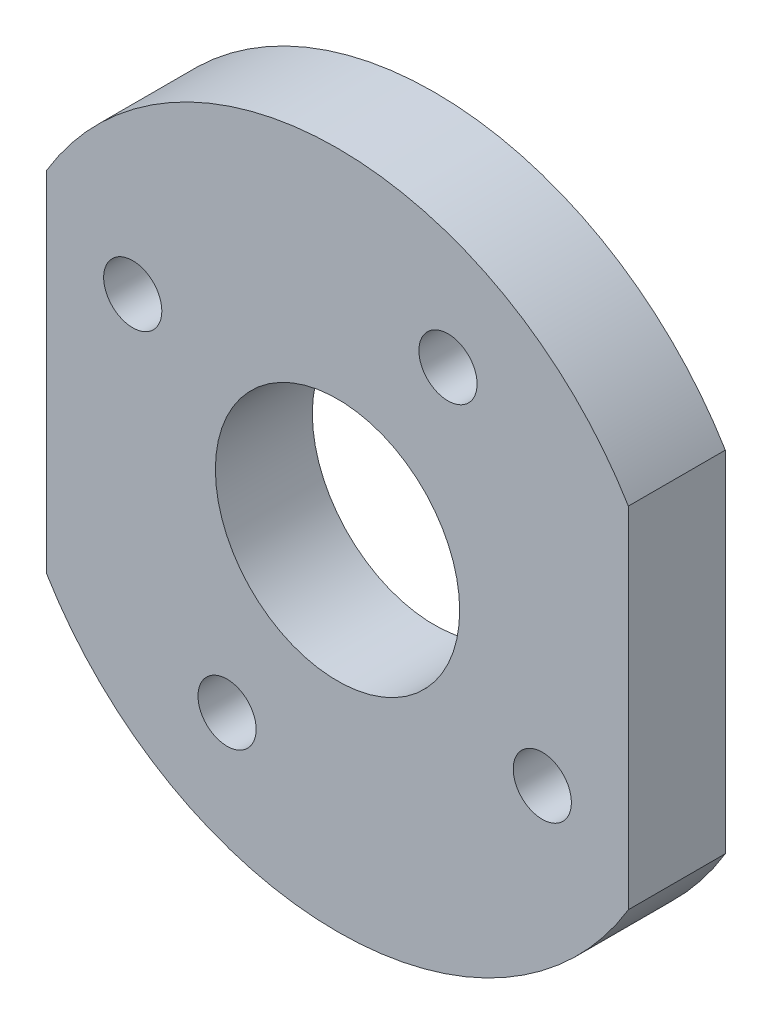
ISO-10303-21;
HEADER;
FILE_DESCRIPTION(('STEP AP214'),'2;1');
FILE_NAME('part.step','',(''),(''),'','','');
FILE_SCHEMA(('AUTOMOTIVE_DESIGN { 1 0 10303 214 1 1 1 1 }'));
ENDSEC;
DATA;
#1=APPLICATION_CONTEXT('core data for automotive mechanical design processes');
#2=APPLICATION_PROTOCOL_DEFINITION('international standard','automotive_design',2000,#1);
#3=PRODUCT_CONTEXT('',#1,'mechanical');
#4=PRODUCT('Part','Part','',(#3));
#5=PRODUCT_RELATED_PRODUCT_CATEGORY('part','',(#4));
#6=PRODUCT_DEFINITION_FORMATION('','',#4);
#7=PRODUCT_DEFINITION_CONTEXT('part definition',#1,'design');
#8=PRODUCT_DEFINITION('design','',#6,#7);
#9=PRODUCT_DEFINITION_SHAPE('','',#8);
#10=(LENGTH_UNIT() NAMED_UNIT(*) SI_UNIT(.MILLI.,.METRE.));
#11=(NAMED_UNIT(*) PLANE_ANGLE_UNIT() SI_UNIT($,.RADIAN.));
#12=(NAMED_UNIT(*) SI_UNIT($,.STERADIAN.) SOLID_ANGLE_UNIT());
#13=UNCERTAINTY_MEASURE_WITH_UNIT(LENGTH_MEASURE(1.E-05),#10,'distance_accuracy_value','');
#14=(GEOMETRIC_REPRESENTATION_CONTEXT(3) GLOBAL_UNCERTAINTY_ASSIGNED_CONTEXT((#13)) GLOBAL_UNIT_ASSIGNED_CONTEXT((#10,
#11,#12)) REPRESENTATION_CONTEXT('',''));
#15=CARTESIAN_POINT('',(0.,0.,0.));
#16=DIRECTION('',(0.,0.,1.));
#17=DIRECTION('',(1.,0.,0.));
#18=AXIS2_PLACEMENT_3D('',#15,#16,#17);
#19=CARTESIAN_POINT('',(11.3450830399455,56.0226036821632,5.));
#20=DIRECTION('',(0.,0.,1.));
#21=DIRECTION('',(1.,0.,0.));
#22=AXIS2_PLACEMENT_3D('',#19,#20,#21);
#23=PLANE('',#22);
#24=CARTESIAN_POINT('',(0.783804127321347,61.7199177625855,5.));
#25=DIRECTION('',(0.,0.,1.));
#26=DIRECTION('',(1.,0.,0.));
#27=AXIS2_PLACEMENT_3D('',#24,#25,#26);
#28=CIRCLE('',#27,1.5);
#29=CARTESIAN_POINT('',(2.28380412732135,61.7199177625855,5.));
#30=VERTEX_POINT('',#29);
#31=EDGE_CURVE('E128',#30,#30,#28,.T.);
#32=ORIENTED_EDGE('',*,*,#31,.F.);
#33=EDGE_LOOP('',(#32));
#34=FACE_BOUND('',#33,.T.);
#35=CARTESIAN_POINT('',(17.0423971202988,66.5838825947678,5.));
#36=DIRECTION('',(0.,0.,1.));
#37=DIRECTION('',(1.,0.,0.));
#38=AXIS2_PLACEMENT_3D('',#35,#36,#37);
#39=CIRCLE('',#38,1.5);
#40=CARTESIAN_POINT('',(18.5423971202988,66.5838825947678,5.));
#41=VERTEX_POINT('',#40);
#42=EDGE_CURVE('E116',#41,#41,#39,.T.);
#43=ORIENTED_EDGE('',*,*,#42,.F.);
#44=EDGE_LOOP('',(#43));
#45=FACE_BOUND('',#44,.T.);
#46=CARTESIAN_POINT('',(11.3450830399455,56.0226036821632,5.));
#47=DIRECTION('',(0.,0.,1.));
#48=DIRECTION('',(1.,0.,0.));
#49=AXIS2_PLACEMENT_3D('',#46,#47,#48);
#50=CIRCLE('',#49,17.5);
#51=CARTESIAN_POINT('',(-3.65491696005452,47.0087254935032,5.));
#52=VERTEX_POINT('',#51);
#53=CARTESIAN_POINT('',(26.3450830399455,47.0087254935032,5.));
#54=VERTEX_POINT('',#53);
#55=EDGE_CURVE('E86',#52,#54,#50,.T.);
#56=ORIENTED_EDGE('',*,*,#55,.T.);
#57=DIRECTION('',(0.,1.,0.));
#58=VECTOR('',#57,1.);
#59=CARTESIAN_POINT('',(26.3450830399455,65.0364818708231,5.));
#60=LINE('',#59,#58);
#61=CARTESIAN_POINT('',(26.3450830399455,65.0364818708231,5.));
#62=VERTEX_POINT('',#61);
#63=EDGE_CURVE('E81',#54,#62,#60,.T.);
#64=ORIENTED_EDGE('',*,*,#63,.T.);
#65=CARTESIAN_POINT('',(11.3450830399455,56.0226036821632,5.));
#66=DIRECTION('',(0.,0.,1.));
#67=DIRECTION('',(1.,0.,0.));
#68=AXIS2_PLACEMENT_3D('',#65,#66,#67);
#69=CIRCLE('',#68,17.5);
#70=CARTESIAN_POINT('',(-3.65491696005452,65.0364818708231,5.));
#71=VERTEX_POINT('',#70);
#72=EDGE_CURVE('E84',#62,#71,#69,.T.);
#73=ORIENTED_EDGE('',*,*,#72,.T.);
#74=DIRECTION('',(0.,-1.,0.));
#75=VECTOR('',#74,1.);
#76=CARTESIAN_POINT('',(-3.65491696005452,65.0364818708231,5.));
#77=LINE('',#76,#75);
#78=EDGE_CURVE('E51',#71,#52,#77,.T.);
#79=ORIENTED_EDGE('',*,*,#78,.T.);
#80=EDGE_LOOP('',(#56,#64,#73,#79));
#81=FACE_BOUND('',#80,.T.);
#82=CARTESIAN_POINT('',(11.3450830399455,56.0226036821632,5.));
#83=DIRECTION('',(0.,0.,1.));
#84=DIRECTION('',(1.,0.,0.));
#85=AXIS2_PLACEMENT_3D('',#82,#83,#84);
#86=CIRCLE('',#85,6.3);
#87=CARTESIAN_POINT('',(17.6450830399455,56.0226036821632,5.));
#88=VERTEX_POINT('',#87);
#89=EDGE_CURVE('E101',#88,#88,#86,.T.);
#90=ORIENTED_EDGE('',*,*,#89,.F.);
#91=EDGE_LOOP('',(#90));
#92=FACE_BOUND('',#91,.T.);
#93=CARTESIAN_POINT('',(5.64776895950356,45.4613247696081,5.));
#94=DIRECTION('',(0.,0.,1.));
#95=DIRECTION('',(1.,0.,0.));
#96=AXIS2_PLACEMENT_3D('',#93,#94,#95);
#97=CIRCLE('',#96,1.5);
#98=CARTESIAN_POINT('',(7.14776895950356,45.4613247696081,5.));
#99=VERTEX_POINT('',#98);
#100=EDGE_CURVE('E122',#99,#99,#97,.T.);
#101=ORIENTED_EDGE('',*,*,#100,.F.);
#102=EDGE_LOOP('',(#101));
#103=FACE_BOUND('',#102,.T.);
#104=CARTESIAN_POINT('',(21.9063619524873,50.3252896017871,5.));
#105=DIRECTION('',(0.,0.,1.));
#106=DIRECTION('',(1.,0.,0.));
#107=AXIS2_PLACEMENT_3D('',#104,#105,#106);
#108=CIRCLE('',#107,1.5);
#109=CARTESIAN_POINT('',(23.4063619524873,50.3252896017871,5.));
#110=VERTEX_POINT('',#109);
#111=EDGE_CURVE('E134',#110,#110,#108,.T.);
#112=ORIENTED_EDGE('',*,*,#111,.F.);
#113=EDGE_LOOP('',(#112));
#114=FACE_BOUND('',#113,.T.);
#115=ADVANCED_FACE('F34',(#34,#45,#81,#92,#103,#114),#23,.T.);
#116=CARTESIAN_POINT('',(11.3450830399455,56.0226036821632,0.));
#117=DIRECTION('',(0.,0.,1.));
#118=DIRECTION('',(1.,0.,0.));
#119=AXIS2_PLACEMENT_3D('',#116,#117,#118);
#120=PLANE('',#119);
#121=CARTESIAN_POINT('',(11.3450830399455,56.0226036821632,0.));
#122=DIRECTION('',(0.,0.,1.));
#123=DIRECTION('',(1.,0.,0.));
#124=AXIS2_PLACEMENT_3D('',#121,#122,#123);
#125=CIRCLE('',#124,17.5);
#126=CARTESIAN_POINT('',(-3.65491696005452,47.0087254935032,0.));
#127=VERTEX_POINT('',#126);
#128=CARTESIAN_POINT('',(26.3450830399455,47.0087254935032,0.));
#129=VERTEX_POINT('',#128);
#130=EDGE_CURVE('E98',#127,#129,#125,.T.);
#131=ORIENTED_EDGE('',*,*,#130,.F.);
#132=DIRECTION('',(0.,-1.,0.));
#133=VECTOR('',#132,1.);
#134=CARTESIAN_POINT('',(-3.65491696005452,65.0364818708231,0.));
#135=LINE('',#134,#133);
#136=CARTESIAN_POINT('',(-3.65491696005452,65.0364818708231,0.));
#137=VERTEX_POINT('',#136);
#138=EDGE_CURVE('E74',#137,#127,#135,.T.);
#139=ORIENTED_EDGE('',*,*,#138,.F.);
#140=CARTESIAN_POINT('',(11.3450830399455,56.0226036821632,0.));
#141=DIRECTION('',(0.,0.,1.));
#142=DIRECTION('',(1.,0.,0.));
#143=AXIS2_PLACEMENT_3D('',#140,#141,#142);
#144=CIRCLE('',#143,17.5);
#145=CARTESIAN_POINT('',(26.3450830399455,65.0364818708231,0.));
#146=VERTEX_POINT('',#145);
#147=EDGE_CURVE('E68',#146,#137,#144,.T.);
#148=ORIENTED_EDGE('',*,*,#147,.F.);
#149=DIRECTION('',(0.,1.,0.));
#150=VECTOR('',#149,1.);
#151=CARTESIAN_POINT('',(26.3450830399455,65.0364818708231,0.));
#152=LINE('',#151,#150);
#153=EDGE_CURVE('E90',#129,#146,#152,.T.);
#154=ORIENTED_EDGE('',*,*,#153,.F.);
#155=EDGE_LOOP('',(#131,#139,#148,#154));
#156=FACE_BOUND('',#155,.T.);
#157=CARTESIAN_POINT('',(11.3450830399455,56.0226036821632,0.));
#158=DIRECTION('',(0.,0.,1.));
#159=DIRECTION('',(1.,0.,0.));
#160=AXIS2_PLACEMENT_3D('',#157,#158,#159);
#161=CIRCLE('',#160,6.3);
#162=CARTESIAN_POINT('',(17.6450830399455,56.0226036821632,0.));
#163=VERTEX_POINT('',#162);
#164=EDGE_CURVE('E113',#163,#163,#161,.T.);
#165=ORIENTED_EDGE('',*,*,#164,.T.);
#166=EDGE_LOOP('',(#165));
#167=FACE_BOUND('',#166,.T.);
#168=CARTESIAN_POINT('',(17.0423971202988,66.5838825947678,0.));
#169=DIRECTION('',(0.,0.,1.));
#170=DIRECTION('',(1.,0.,0.));
#171=AXIS2_PLACEMENT_3D('',#168,#169,#170);
#172=CIRCLE('',#171,1.5);
#173=CARTESIAN_POINT('',(18.5423971202988,66.5838825947678,0.));
#174=VERTEX_POINT('',#173);
#175=EDGE_CURVE('E119',#174,#174,#172,.T.);
#176=ORIENTED_EDGE('',*,*,#175,.T.);
#177=EDGE_LOOP('',(#176));
#178=FACE_BOUND('',#177,.T.);
#179=CARTESIAN_POINT('',(5.64776895950356,45.4613247696081,0.));
#180=DIRECTION('',(0.,0.,1.));
#181=DIRECTION('',(1.,0.,0.));
#182=AXIS2_PLACEMENT_3D('',#179,#180,#181);
#183=CIRCLE('',#182,1.5);
#184=CARTESIAN_POINT('',(7.14776895950356,45.4613247696081,0.));
#185=VERTEX_POINT('',#184);
#186=EDGE_CURVE('E125',#185,#185,#183,.T.);
#187=ORIENTED_EDGE('',*,*,#186,.T.);
#188=EDGE_LOOP('',(#187));
#189=FACE_BOUND('',#188,.T.);
#190=CARTESIAN_POINT('',(0.783804127321347,61.7199177625855,0.));
#191=DIRECTION('',(0.,0.,1.));
#192=DIRECTION('',(1.,0.,0.));
#193=AXIS2_PLACEMENT_3D('',#190,#191,#192);
#194=CIRCLE('',#193,1.5);
#195=CARTESIAN_POINT('',(2.28380412732135,61.7199177625855,0.));
#196=VERTEX_POINT('',#195);
#197=EDGE_CURVE('E131',#196,#196,#194,.T.);
#198=ORIENTED_EDGE('',*,*,#197,.T.);
#199=EDGE_LOOP('',(#198));
#200=FACE_BOUND('',#199,.T.);
#201=CARTESIAN_POINT('',(21.9063619524873,50.3252896017871,0.));
#202=DIRECTION('',(0.,0.,1.));
#203=DIRECTION('',(1.,0.,0.));
#204=AXIS2_PLACEMENT_3D('',#201,#202,#203);
#205=CIRCLE('',#204,1.5);
#206=CARTESIAN_POINT('',(23.4063619524873,50.3252896017871,0.));
#207=VERTEX_POINT('',#206);
#208=EDGE_CURVE('E137',#207,#207,#205,.T.);
#209=ORIENTED_EDGE('',*,*,#208,.T.);
#210=EDGE_LOOP('',(#209));
#211=FACE_BOUND('',#210,.T.);
#212=ADVANCED_FACE('F109',(#156,#167,#178,#189,#200,#211),#120,.F.);
#213=CARTESIAN_POINT('',(11.3450830399455,56.0226036821632,5.));
#214=DIRECTION('',(0.,0.,-1.));
#215=DIRECTION('',(-1.,0.,0.));
#216=AXIS2_PLACEMENT_3D('',#213,#214,#215);
#217=CYLINDRICAL_SURFACE('',#216,17.5);
#218=ORIENTED_EDGE('',*,*,#130,.T.);
#219=DIRECTION('',(0.,0.,-1.));
#220=VECTOR('',#219,1.);
#221=CARTESIAN_POINT('',(26.3450830399455,47.0087254935032,5.));
#222=LINE('',#221,#220);
#223=EDGE_CURVE('E11',#54,#129,#222,.T.);
#224=ORIENTED_EDGE('',*,*,#223,.F.);
#225=ORIENTED_EDGE('',*,*,#55,.F.);
#226=DIRECTION('',(0.,0.,-1.));
#227=VECTOR('',#226,1.);
#228=CARTESIAN_POINT('',(-3.65491696005452,47.0087254935032,5.));
#229=LINE('',#228,#227);
#230=EDGE_CURVE('E94',#52,#127,#229,.T.);
#231=ORIENTED_EDGE('',*,*,#230,.T.);
#232=EDGE_LOOP('',(#218,#224,#225,#231));
#233=FACE_BOUND('',#232,.T.);
#234=ADVANCED_FACE('F36',(#233),#217,.T.);
#235=CARTESIAN_POINT('',(26.3450830399455,65.0364818708231,5.));
#236=DIRECTION('',(-1.,0.,0.));
#237=DIRECTION('',(0.,-1.,0.));
#238=AXIS2_PLACEMENT_3D('',#235,#236,#237);
#239=PLANE('',#238);
#240=ORIENTED_EDGE('',*,*,#153,.T.);
#241=DIRECTION('',(0.,0.,-1.));
#242=VECTOR('',#241,1.);
#243=CARTESIAN_POINT('',(26.3450830399455,65.0364818708231,5.));
#244=LINE('',#243,#242);
#245=EDGE_CURVE('E43',#62,#146,#244,.T.);
#246=ORIENTED_EDGE('',*,*,#245,.F.);
#247=ORIENTED_EDGE('',*,*,#63,.F.);
#248=ORIENTED_EDGE('',*,*,#223,.T.);
#249=EDGE_LOOP('',(#240,#246,#247,#248));
#250=FACE_BOUND('',#249,.T.);
#251=ADVANCED_FACE('F89',(#250),#239,.F.);
#252=CARTESIAN_POINT('',(11.3450830399455,56.0226036821632,5.));
#253=DIRECTION('',(0.,0.,-1.));
#254=DIRECTION('',(-1.,0.,0.));
#255=AXIS2_PLACEMENT_3D('',#252,#253,#254);
#256=CYLINDRICAL_SURFACE('',#255,17.5);
#257=ORIENTED_EDGE('',*,*,#147,.T.);
#258=DIRECTION('',(0.,0.,-1.));
#259=VECTOR('',#258,1.);
#260=CARTESIAN_POINT('',(-3.65491696005452,65.0364818708231,5.));
#261=LINE('',#260,#259);
#262=EDGE_CURVE('E91',#71,#137,#261,.T.);
#263=ORIENTED_EDGE('',*,*,#262,.F.);
#264=ORIENTED_EDGE('',*,*,#72,.F.);
#265=ORIENTED_EDGE('',*,*,#245,.T.);
#266=EDGE_LOOP('',(#257,#263,#264,#265));
#267=FACE_BOUND('',#266,.T.);
#268=ADVANCED_FACE('F92',(#267),#256,.T.);
#269=CARTESIAN_POINT('',(-3.65491696005452,65.0364818708231,5.));
#270=DIRECTION('',(1.,0.,0.));
#271=DIRECTION('',(0.,1.,0.));
#272=AXIS2_PLACEMENT_3D('',#269,#270,#271);
#273=PLANE('',#272);
#274=ORIENTED_EDGE('',*,*,#138,.T.);
#275=ORIENTED_EDGE('',*,*,#230,.F.);
#276=ORIENTED_EDGE('',*,*,#78,.F.);
#277=ORIENTED_EDGE('',*,*,#262,.T.);
#278=EDGE_LOOP('',(#274,#275,#276,#277));
#279=FACE_BOUND('',#278,.T.);
#280=ADVANCED_FACE('F106',(#279),#273,.F.);
#281=CARTESIAN_POINT('',(11.3450830399455,56.0226036821632,5.));
#282=DIRECTION('',(0.,0.,-1.));
#283=DIRECTION('',(-1.,0.,0.));
#284=AXIS2_PLACEMENT_3D('',#281,#282,#283);
#285=CYLINDRICAL_SURFACE('',#284,6.3);
#286=ORIENTED_EDGE('',*,*,#89,.T.);
#287=EDGE_LOOP('',(#286));
#288=FACE_BOUND('',#287,.T.);
#289=ORIENTED_EDGE('',*,*,#164,.F.);
#290=EDGE_LOOP('',(#289));
#291=FACE_BOUND('',#290,.T.);
#292=ADVANCED_FACE('F156',(#288,#291),#285,.F.);
#293=CARTESIAN_POINT('',(17.0423971202988,66.5838825947678,5.));
#294=DIRECTION('',(0.,0.,-1.));
#295=DIRECTION('',(-1.,0.,0.));
#296=AXIS2_PLACEMENT_3D('',#293,#294,#295);
#297=CYLINDRICAL_SURFACE('',#296,1.5);
#298=ORIENTED_EDGE('',*,*,#42,.T.);
#299=EDGE_LOOP('',(#298));
#300=FACE_BOUND('',#299,.T.);
#301=ORIENTED_EDGE('',*,*,#175,.F.);
#302=EDGE_LOOP('',(#301));
#303=FACE_BOUND('',#302,.T.);
#304=ADVANCED_FACE('F202',(#300,#303),#297,.F.);
#305=CARTESIAN_POINT('',(5.64776895950356,45.4613247696081,5.));
#306=DIRECTION('',(0.,0.,-1.));
#307=DIRECTION('',(-1.,0.,0.));
#308=AXIS2_PLACEMENT_3D('',#305,#306,#307);
#309=CYLINDRICAL_SURFACE('',#308,1.5);
#310=ORIENTED_EDGE('',*,*,#100,.T.);
#311=EDGE_LOOP('',(#310));
#312=FACE_BOUND('',#311,.T.);
#313=ORIENTED_EDGE('',*,*,#186,.F.);
#314=EDGE_LOOP('',(#313));
#315=FACE_BOUND('',#314,.T.);
#316=ADVANCED_FACE('F210',(#312,#315),#309,.F.);
#317=CARTESIAN_POINT('',(0.783804127321347,61.7199177625855,5.));
#318=DIRECTION('',(0.,0.,-1.));
#319=DIRECTION('',(-1.,0.,0.));
#320=AXIS2_PLACEMENT_3D('',#317,#318,#319);
#321=CYLINDRICAL_SURFACE('',#320,1.5);
#322=ORIENTED_EDGE('',*,*,#31,.T.);
#323=EDGE_LOOP('',(#322));
#324=FACE_BOUND('',#323,.T.);
#325=ORIENTED_EDGE('',*,*,#197,.F.);
#326=EDGE_LOOP('',(#325));
#327=FACE_BOUND('',#326,.T.);
#328=ADVANCED_FACE('F218',(#324,#327),#321,.F.);
#329=CARTESIAN_POINT('',(21.9063619524873,50.3252896017871,5.));
#330=DIRECTION('',(0.,0.,-1.));
#331=DIRECTION('',(-1.,0.,0.));
#332=AXIS2_PLACEMENT_3D('',#329,#330,#331);
#333=CYLINDRICAL_SURFACE('',#332,1.5);
#334=ORIENTED_EDGE('',*,*,#111,.T.);
#335=EDGE_LOOP('',(#334));
#336=FACE_BOUND('',#335,.T.);
#337=ORIENTED_EDGE('',*,*,#208,.F.);
#338=EDGE_LOOP('',(#337));
#339=FACE_BOUND('',#338,.T.);
#340=ADVANCED_FACE('F143',(#336,#339),#333,.F.);
#341=CLOSED_SHELL('',(#115,#212,#234,#251,#268,#280,#292,#304,#316,#328,#340));
#342=MANIFOLD_SOLID_BREP('B2',#341);
#343=ADVANCED_BREP_SHAPE_REPRESENTATION('',(#18,#342),#14);
#344=SHAPE_DEFINITION_REPRESENTATION(#9,#343);
ENDSEC;
END-ISO-10303-21;
